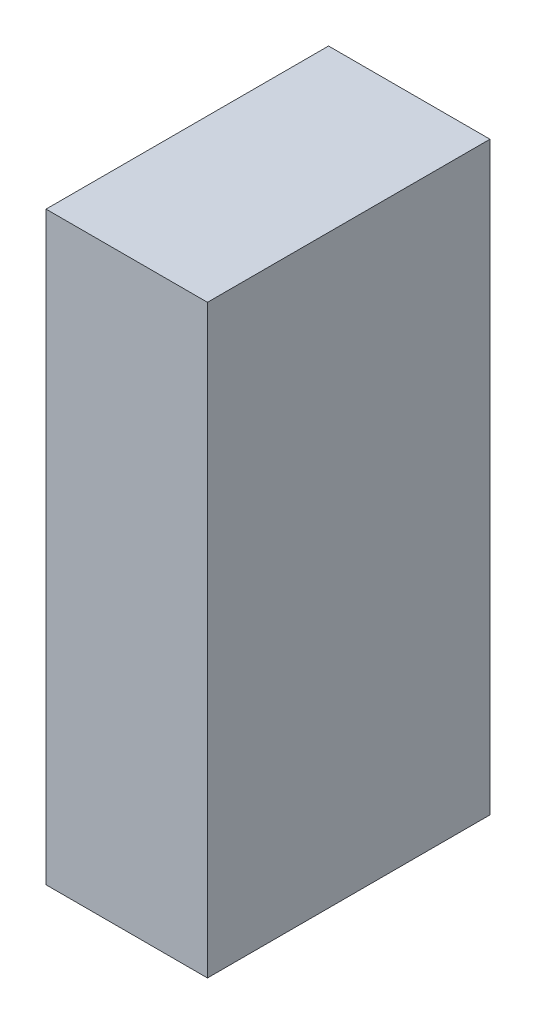
ISO-10303-21;
HEADER;
FILE_DESCRIPTION(('STEP AP214'),'2;1');
FILE_NAME('part.step','',(''),(''),'','','');
FILE_SCHEMA(('AUTOMOTIVE_DESIGN { 1 0 10303 214 1 1 1 1 }'));
ENDSEC;
DATA;
#1=APPLICATION_CONTEXT('core data for automotive mechanical design processes');
#2=APPLICATION_PROTOCOL_DEFINITION('international standard','automotive_design',2000,#1);
#3=PRODUCT_CONTEXT('',#1,'mechanical');
#4=PRODUCT('Part','Part','',(#3));
#5=PRODUCT_RELATED_PRODUCT_CATEGORY('part','',(#4));
#6=PRODUCT_DEFINITION_FORMATION('','',#4);
#7=PRODUCT_DEFINITION_CONTEXT('part definition',#1,'design');
#8=PRODUCT_DEFINITION('design','',#6,#7);
#9=PRODUCT_DEFINITION_SHAPE('','',#8);
#10=(LENGTH_UNIT() NAMED_UNIT(*) SI_UNIT(.MILLI.,.METRE.));
#11=(NAMED_UNIT(*) PLANE_ANGLE_UNIT() SI_UNIT($,.RADIAN.));
#12=(NAMED_UNIT(*) SI_UNIT($,.STERADIAN.) SOLID_ANGLE_UNIT());
#13=UNCERTAINTY_MEASURE_WITH_UNIT(LENGTH_MEASURE(1.E-05),#10,'distance_accuracy_value','');
#14=(GEOMETRIC_REPRESENTATION_CONTEXT(3) GLOBAL_UNCERTAINTY_ASSIGNED_CONTEXT((#13)) GLOBAL_UNIT_ASSIGNED_CONTEXT((#10,
#11,#12)) REPRESENTATION_CONTEXT('',''));
#15=CARTESIAN_POINT('',(0.,0.,0.));
#16=DIRECTION('',(0.,0.,1.));
#17=DIRECTION('',(1.,0.,0.));
#18=AXIS2_PLACEMENT_3D('',#15,#16,#17);
#19=CARTESIAN_POINT('',(-1.09999622536174,0.724970590818884,0.));
#20=DIRECTION('',(-1.,4.37113882867379E-08,0.));
#21=DIRECTION('',(-4.37113882867379E-08,-1.,0.));
#22=AXIS2_PLACEMENT_3D('',#19,#20,#21);
#23=PLANE('',#22);
#24=DIRECTION('',(-4.37113883156005E-08,-0.999999999999999,0.));
#25=VECTOR('',#24,1.);
#26=CARTESIAN_POINT('',(-1.09999622536174,0.724970590818884,0.));
#27=LINE('',#26,#25);
#28=CARTESIAN_POINT('',(-1.09999622536174,0.724970590818884,0.));
#29=VERTEX_POINT('',#28);
#30=CARTESIAN_POINT('',(-1.09999628874245,-0.725011098634241,0.));
#31=VERTEX_POINT('',#30);
#32=EDGE_CURVE('E11',#29,#31,#27,.T.);
#33=ORIENTED_EDGE('',*,*,#32,.T.);
#34=DIRECTION('',(0.,0.,1.));
#35=VECTOR('',#34,1.);
#36=CARTESIAN_POINT('',(-1.09999628874245,-0.725011098634241,0.));
#37=LINE('',#36,#35);
#38=CARTESIAN_POINT('',(-1.09999628874245,-0.725011098634241,0.700001120567322));
#39=VERTEX_POINT('',#38);
#40=EDGE_CURVE('E88',#31,#39,#37,.T.);
#41=ORIENTED_EDGE('',*,*,#40,.T.);
#42=DIRECTION('',(-4.37113883156005E-08,-0.999999999999999,0.));
#43=VECTOR('',#42,1.);
#44=CARTESIAN_POINT('',(-1.09999622536174,0.724970590818884,0.700001120567322));
#45=LINE('',#44,#43);
#46=CARTESIAN_POINT('',(-1.09999622536174,0.724970590818884,0.700001120567322));
#47=VERTEX_POINT('',#46);
#48=EDGE_CURVE('E83',#47,#39,#45,.T.);
#49=ORIENTED_EDGE('',*,*,#48,.F.);
#50=DIRECTION('',(0.,0.,1.));
#51=VECTOR('',#50,1.);
#52=CARTESIAN_POINT('',(-1.09999622536174,0.724970590818861,0.));
#53=LINE('',#52,#51);
#54=EDGE_CURVE('E72',#29,#47,#53,.T.);
#55=ORIENTED_EDGE('',*,*,#54,.F.);
#56=EDGE_LOOP('',(#33,#41,#49,#55));
#57=FACE_BOUND('',#56,.T.);
#58=ADVANCED_FACE('F17',(#57),#23,.T.);
#59=CARTESIAN_POINT('',(-1.09999628874245,-0.725011098634241,0.));
#60=DIRECTION('',(-4.37113882867379E-08,-1.,0.));
#61=DIRECTION('',(1.,-4.37113882867379E-08,0.));
#62=AXIS2_PLACEMENT_3D('',#59,#60,#61);
#63=PLANE('',#62);
#64=DIRECTION('',(0.999999999999999,-4.37113882344263E-08,0.));
#65=VECTOR('',#64,1.);
#66=CARTESIAN_POINT('',(-1.09999628874245,-0.725011098634241,0.));
#67=LINE('',#66,#65);
#68=CARTESIAN_POINT('',(-0.699987133469008,-0.725011116119219,0.));
#69=VERTEX_POINT('',#68);
#70=EDGE_CURVE('E24',#31,#69,#67,.T.);
#71=ORIENTED_EDGE('',*,*,#70,.T.);
#72=DIRECTION('',(0.,0.,1.));
#73=VECTOR('',#72,1.);
#74=CARTESIAN_POINT('',(-0.699987133469008,-0.725011116119196,0.));
#75=LINE('',#74,#73);
#76=CARTESIAN_POINT('',(-0.699987133469008,-0.725011116119219,0.700001120567322));
#77=VERTEX_POINT('',#76);
#78=EDGE_CURVE('E85',#69,#77,#75,.T.);
#79=ORIENTED_EDGE('',*,*,#78,.T.);
#80=DIRECTION('',(0.999999999999999,-4.37113882344263E-08,0.));
#81=VECTOR('',#80,1.);
#82=CARTESIAN_POINT('',(-1.09999628874245,-0.725011098634241,0.700001120567322));
#83=LINE('',#82,#81);
#84=EDGE_CURVE('E66',#39,#77,#83,.T.);
#85=ORIENTED_EDGE('',*,*,#84,.F.);
#86=ORIENTED_EDGE('',*,*,#40,.F.);
#87=EDGE_LOOP('',(#71,#79,#85,#86));
#88=FACE_BOUND('',#87,.T.);
#89=ADVANCED_FACE('F89',(#88),#63,.T.);
#90=CARTESIAN_POINT('',(-0.699987133469008,-0.725011116119219,0.));
#91=DIRECTION('',(1.,-4.37113882867379E-08,0.));
#92=DIRECTION('',(4.37113882867379E-08,1.,0.));
#93=AXIS2_PLACEMENT_3D('',#90,#91,#92);
#94=PLANE('',#93);
#95=DIRECTION('',(4.37113883156005E-08,0.999999999999999,0.));
#96=VECTOR('',#95,1.);
#97=CARTESIAN_POINT('',(-0.699987133469008,-0.725011116119219,0.));
#98=LINE('',#97,#96);
#99=CARTESIAN_POINT('',(-0.699987070088298,0.724970573333906,0.));
#100=VERTEX_POINT('',#99);
#101=EDGE_CURVE('E62',#69,#100,#98,.T.);
#102=ORIENTED_EDGE('',*,*,#101,.T.);
#103=DIRECTION('',(0.,0.,1.));
#104=VECTOR('',#103,1.);
#105=CARTESIAN_POINT('',(-0.699987070088296,0.724970573333906,0.));
#106=LINE('',#105,#104);
#107=CARTESIAN_POINT('',(-0.699987070088298,0.724970573333906,0.700001120567322));
#108=VERTEX_POINT('',#107);
#109=EDGE_CURVE('E55',#100,#108,#106,.T.);
#110=ORIENTED_EDGE('',*,*,#109,.T.);
#111=DIRECTION('',(4.37113883156005E-08,0.999999999999999,0.));
#112=VECTOR('',#111,1.);
#113=CARTESIAN_POINT('',(-0.699987133469008,-0.725011116119219,0.700001120567322));
#114=LINE('',#113,#112);
#115=EDGE_CURVE('E59',#77,#108,#114,.T.);
#116=ORIENTED_EDGE('',*,*,#115,.F.);
#117=ORIENTED_EDGE('',*,*,#78,.F.);
#118=EDGE_LOOP('',(#102,#110,#116,#117));
#119=FACE_BOUND('',#118,.T.);
#120=ADVANCED_FACE('F57',(#119),#94,.T.);
#121=CARTESIAN_POINT('',(-0.699987070088298,0.724970573333906,0.));
#122=DIRECTION('',(4.37113882867379E-08,1.,0.));
#123=DIRECTION('',(-1.,4.37113882867379E-08,0.));
#124=AXIS2_PLACEMENT_3D('',#121,#122,#123);
#125=PLANE('',#124);
#126=DIRECTION('',(-0.999999999999999,4.37113882344263E-08,0.));
#127=VECTOR('',#126,1.);
#128=CARTESIAN_POINT('',(-0.699987070088298,0.724970573333906,0.));
#129=LINE('',#128,#127);
#130=EDGE_CURVE('E65',#100,#29,#129,.T.);
#131=ORIENTED_EDGE('',*,*,#130,.T.);
#132=ORIENTED_EDGE('',*,*,#54,.T.);
#133=DIRECTION('',(-0.999999999999999,4.37113882344263E-08,0.));
#134=VECTOR('',#133,1.);
#135=CARTESIAN_POINT('',(-0.699987070088298,0.724970573333906,0.700001120567322));
#136=LINE('',#135,#134);
#137=EDGE_CURVE('E70',#108,#47,#136,.T.);
#138=ORIENTED_EDGE('',*,*,#137,.F.);
#139=ORIENTED_EDGE('',*,*,#109,.F.);
#140=EDGE_LOOP('',(#131,#132,#138,#139));
#141=FACE_BOUND('',#140,.T.);
#142=ADVANCED_FACE('F71',(#141),#125,.T.);
#143=CARTESIAN_POINT('',(-115.374969482422,472.899963378906,0.700001120567322));
#144=DIRECTION('',(0.,0.,1.));
#145=DIRECTION('',(-4.37113882867379E-08,-1.,0.));
#146=AXIS2_PLACEMENT_3D('',#143,#144,#145);
#147=PLANE('',#146);
#148=ORIENTED_EDGE('',*,*,#48,.T.);
#149=ORIENTED_EDGE('',*,*,#84,.T.);
#150=ORIENTED_EDGE('',*,*,#115,.T.);
#151=ORIENTED_EDGE('',*,*,#137,.T.);
#152=EDGE_LOOP('',(#148,#149,#150,#151));
#153=FACE_BOUND('',#152,.T.);
#154=ADVANCED_FACE('F76',(#153),#147,.T.);
#155=CARTESIAN_POINT('',(-115.374969482422,472.899963378906,0.));
#156=DIRECTION('',(0.,0.,1.));
#157=DIRECTION('',(-4.37113882867379E-08,-1.,0.));
#158=AXIS2_PLACEMENT_3D('',#155,#156,#157);
#159=PLANE('',#158);
#160=ORIENTED_EDGE('',*,*,#130,.F.);
#161=ORIENTED_EDGE('',*,*,#101,.F.);
#162=ORIENTED_EDGE('',*,*,#70,.F.);
#163=ORIENTED_EDGE('',*,*,#32,.F.);
#164=EDGE_LOOP('',(#160,#161,#162,#163));
#165=FACE_BOUND('',#164,.T.);
#166=ADVANCED_FACE('F91',(#165),#159,.F.);
#167=CLOSED_SHELL('',(#58,#89,#120,#142,#154,#166));
#168=MANIFOLD_SOLID_BREP('B1',#167);
#169=ADVANCED_BREP_SHAPE_REPRESENTATION('',(#18,#168),#14);
#170=SHAPE_DEFINITION_REPRESENTATION(#9,#169);
ENDSEC;
END-ISO-10303-21;
